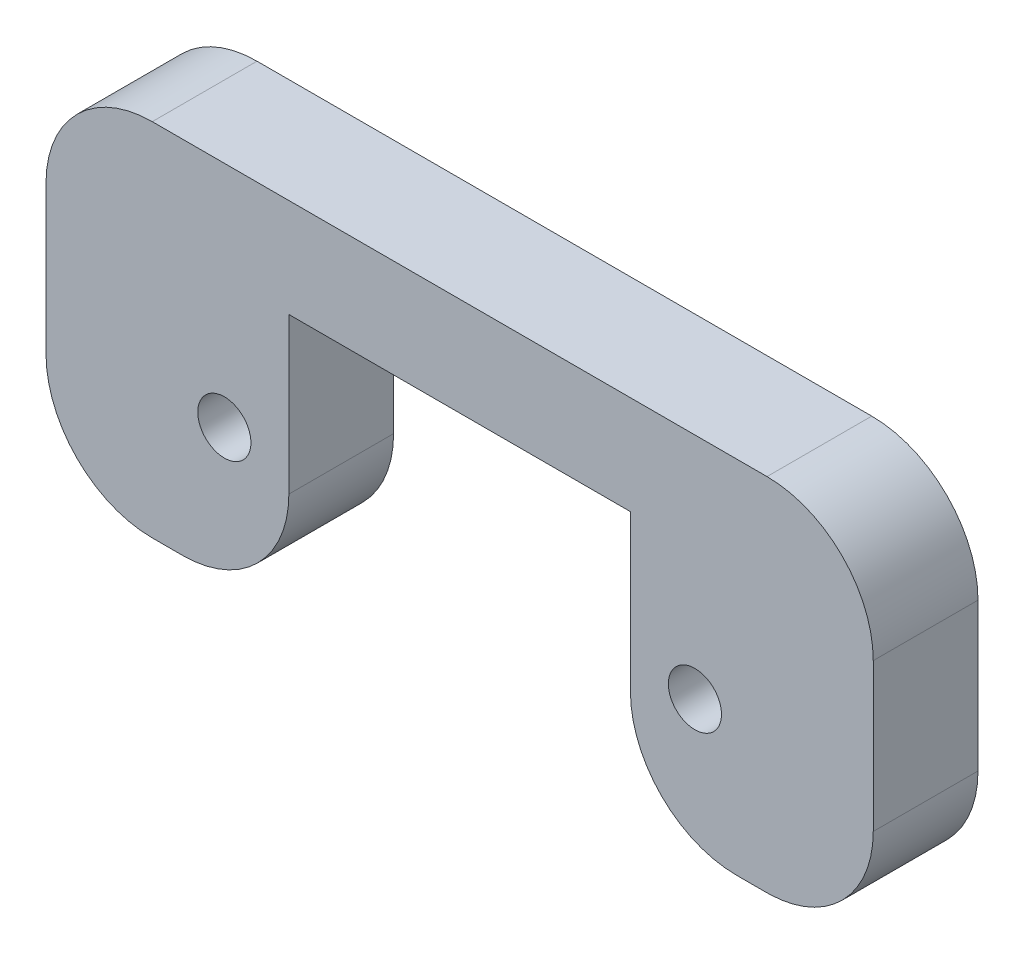
ISO-10303-21;
HEADER;
FILE_DESCRIPTION(('STEP AP214'),'2;1');
FILE_NAME('part.step','',(''),(''),'','','');
FILE_SCHEMA(('AUTOMOTIVE_DESIGN { 1 0 10303 214 1 1 1 1 }'));
ENDSEC;
DATA;
#1=APPLICATION_CONTEXT('core data for automotive mechanical design processes');
#2=APPLICATION_PROTOCOL_DEFINITION('international standard','automotive_design',2000,#1);
#3=PRODUCT_CONTEXT('',#1,'mechanical');
#4=PRODUCT('Part','Part','',(#3));
#5=PRODUCT_RELATED_PRODUCT_CATEGORY('part','',(#4));
#6=PRODUCT_DEFINITION_FORMATION('','',#4);
#7=PRODUCT_DEFINITION_CONTEXT('part definition',#1,'design');
#8=PRODUCT_DEFINITION('design','',#6,#7);
#9=PRODUCT_DEFINITION_SHAPE('','',#8);
#10=(LENGTH_UNIT() NAMED_UNIT(*) SI_UNIT(.MILLI.,.METRE.));
#11=(NAMED_UNIT(*) PLANE_ANGLE_UNIT() SI_UNIT($,.RADIAN.));
#12=(NAMED_UNIT(*) SI_UNIT($,.STERADIAN.) SOLID_ANGLE_UNIT());
#13=UNCERTAINTY_MEASURE_WITH_UNIT(LENGTH_MEASURE(1.E-05),#10,'distance_accuracy_value','');
#14=(GEOMETRIC_REPRESENTATION_CONTEXT(3) GLOBAL_UNCERTAINTY_ASSIGNED_CONTEXT((#13)) GLOBAL_UNIT_ASSIGNED_CONTEXT((#10,
#11,#12)) REPRESENTATION_CONTEXT('',''));
#15=CARTESIAN_POINT('',(0.,0.,0.));
#16=DIRECTION('',(0.,0.,1.));
#17=DIRECTION('',(1.,0.,0.));
#18=AXIS2_PLACEMENT_3D('',#15,#16,#17);
#19=CARTESIAN_POINT('',(0.,0.,6.9));
#20=DIRECTION('',(0.,0.,1.));
#21=DIRECTION('',(1.,0.,0.));
#22=AXIS2_PLACEMENT_3D('',#19,#20,#21);
#23=PLANE('',#22);
#24=DIRECTION('',(0.,1.,0.));
#25=VECTOR('',#24,1.);
#26=CARTESIAN_POINT('',(-27.25,0.,6.9));
#27=LINE('',#26,#25);
#28=CARTESIAN_POINT('',(-27.25,-73.,6.9));
#29=VERTEX_POINT('',#28);
#30=CARTESIAN_POINT('',(-27.25,-63.25,6.9));
#31=VERTEX_POINT('',#30);
#32=EDGE_CURVE('E167',#29,#31,#27,.T.);
#33=ORIENTED_EDGE('',*,*,#32,.F.);
#34=CARTESIAN_POINT('',(-20.25,-73.,6.9));
#35=DIRECTION('',(0.,0.,1.));
#36=DIRECTION('',(1.,0.,0.));
#37=AXIS2_PLACEMENT_3D('',#34,#35,#36);
#38=CIRCLE('',#37,7.);
#39=CARTESIAN_POINT('',(-20.25,-80.,6.9));
#40=VERTEX_POINT('',#39);
#41=EDGE_CURVE('E233',#29,#40,#38,.T.);
#42=ORIENTED_EDGE('',*,*,#41,.T.);
#43=DIRECTION('',(1.,0.,0.));
#44=VECTOR('',#43,1.);
#45=CARTESIAN_POINT('',(40.,-80.,6.9));
#46=LINE('',#45,#44);
#47=CARTESIAN_POINT('',(-18.25,-80.,6.9));
#48=VERTEX_POINT('',#47);
#49=EDGE_CURVE('E202',#40,#48,#46,.T.);
#50=ORIENTED_EDGE('',*,*,#49,.T.);
#51=CARTESIAN_POINT('',(-18.25,-73.,6.9));
#52=DIRECTION('',(0.,0.,1.));
#53=DIRECTION('',(1.,0.,0.));
#54=AXIS2_PLACEMENT_3D('',#51,#52,#53);
#55=CIRCLE('',#54,7.);
#56=CARTESIAN_POINT('',(-11.25,-73.,6.9));
#57=VERTEX_POINT('',#56);
#58=EDGE_CURVE('E227',#48,#57,#55,.T.);
#59=ORIENTED_EDGE('',*,*,#58,.T.);
#60=DIRECTION('',(0.,-1.,0.));
#61=VECTOR('',#60,1.);
#62=CARTESIAN_POINT('',(-11.25,0.,6.9));
#63=LINE('',#62,#61);
#64=CARTESIAN_POINT('',(-11.25,-62.75,6.9));
#65=VERTEX_POINT('',#64);
#66=EDGE_CURVE('E181',#65,#57,#63,.T.);
#67=ORIENTED_EDGE('',*,*,#66,.F.);
#68=DIRECTION('',(1.,0.,0.));
#69=VECTOR('',#68,1.);
#70=CARTESIAN_POINT('',(-21.25,-62.75,6.9));
#71=LINE('',#70,#69);
#72=CARTESIAN_POINT('',(11.2500000000001,-62.75,6.9));
#73=VERTEX_POINT('',#72);
#74=EDGE_CURVE('E163',#65,#73,#71,.T.);
#75=ORIENTED_EDGE('',*,*,#74,.T.);
#76=DIRECTION('',(0.,1.,0.));
#77=VECTOR('',#76,1.);
#78=CARTESIAN_POINT('',(11.25,0.,6.9));
#79=LINE('',#78,#77);
#80=CARTESIAN_POINT('',(11.2500000000001,-73.,6.9));
#81=VERTEX_POINT('',#80);
#82=EDGE_CURVE('E179',#81,#73,#79,.T.);
#83=ORIENTED_EDGE('',*,*,#82,.F.);
#84=CARTESIAN_POINT('',(18.2500000000001,-73.,6.9));
#85=DIRECTION('',(0.,0.,1.));
#86=DIRECTION('',(1.,0.,0.));
#87=AXIS2_PLACEMENT_3D('',#84,#85,#86);
#88=CIRCLE('',#87,7.);
#89=CARTESIAN_POINT('',(18.2500000000001,-80.,6.9));
#90=VERTEX_POINT('',#89);
#91=EDGE_CURVE('E225',#81,#90,#88,.T.);
#92=ORIENTED_EDGE('',*,*,#91,.T.);
#93=CARTESIAN_POINT('',(20.,-80.,6.9));
#94=VERTEX_POINT('',#93);
#95=EDGE_CURVE('E206',#90,#94,#46,.T.);
#96=ORIENTED_EDGE('',*,*,#95,.T.);
#97=CARTESIAN_POINT('',(20.,-60.,6.9));
#98=DIRECTION('',(0.,0.,1.));
#99=DIRECTION('',(1.,0.,0.));
#100=AXIS2_PLACEMENT_3D('',#97,#98,#99);
#101=CIRCLE('',#100,20.);
#102=CARTESIAN_POINT('',(20.3846153846155,-79.996301433163,6.9));
#103=VERTEX_POINT('',#102);
#104=EDGE_CURVE('E214',#94,#103,#101,.T.);
#105=ORIENTED_EDGE('',*,*,#104,.T.);
#106=CARTESIAN_POINT('',(20.25,-72.997595931556,6.9));
#107=DIRECTION('',(0.,0.,1.));
#108=DIRECTION('',(1.,0.,0.));
#109=AXIS2_PLACEMENT_3D('',#106,#107,#108);
#110=CIRCLE('',#109,7.);
#111=CARTESIAN_POINT('',(27.25,-72.997595931556,6.9));
#112=VERTEX_POINT('',#111);
#113=EDGE_CURVE('E223',#103,#112,#110,.T.);
#114=ORIENTED_EDGE('',*,*,#113,.T.);
#115=DIRECTION('',(0.,-1.,0.));
#116=VECTOR('',#115,1.);
#117=CARTESIAN_POINT('',(27.2500000000001,0.,6.9));
#118=LINE('',#117,#116);
#119=CARTESIAN_POINT('',(27.25,-63.25,6.9));
#120=VERTEX_POINT('',#119);
#121=EDGE_CURVE('E171',#120,#112,#118,.T.);
#122=ORIENTED_EDGE('',*,*,#121,.F.);
#123=CARTESIAN_POINT('',(20.2500000000001,-63.25,6.9));
#124=DIRECTION('',(0.,0.,1.));
#125=DIRECTION('',(1.,0.,0.));
#126=AXIS2_PLACEMENT_3D('',#123,#124,#125);
#127=CIRCLE('',#126,7.);
#128=CARTESIAN_POINT('',(20.2500000000001,-56.25,6.9));
#129=VERTEX_POINT('',#128);
#130=EDGE_CURVE('E229',#120,#129,#127,.T.);
#131=ORIENTED_EDGE('',*,*,#130,.T.);
#132=DIRECTION('',(1.,0.,0.));
#133=VECTOR('',#132,1.);
#134=CARTESIAN_POINT('',(-21.25,-56.25,6.9));
#135=LINE('',#134,#133);
#136=CARTESIAN_POINT('',(-20.25,-56.25,6.9));
#137=VERTEX_POINT('',#136);
#138=EDGE_CURVE('E196',#137,#129,#135,.T.);
#139=ORIENTED_EDGE('',*,*,#138,.F.);
#140=CARTESIAN_POINT('',(-20.25,-63.25,6.9));
#141=DIRECTION('',(0.,0.,1.));
#142=DIRECTION('',(1.,0.,0.));
#143=AXIS2_PLACEMENT_3D('',#140,#141,#142);
#144=CIRCLE('',#143,7.);
#145=EDGE_CURVE('E231',#137,#31,#144,.T.);
#146=ORIENTED_EDGE('',*,*,#145,.T.);
#147=EDGE_LOOP('',(#33,#42,#50,#59,#67,#75,#83,#92,#96,#105,#114,#122,#131,#139,#146));
#148=FACE_BOUND('',#147,.T.);
#149=CARTESIAN_POINT('',(-15.5,-71.32,6.9));
#150=DIRECTION('',(0.,0.,1.));
#151=DIRECTION('',(1.,0.,0.));
#152=AXIS2_PLACEMENT_3D('',#149,#150,#151);
#153=CIRCLE('',#152,1.75);
#154=CARTESIAN_POINT('',(-13.75,-71.32,6.9));
#155=VERTEX_POINT('',#154);
#156=EDGE_CURVE('E187',#155,#155,#153,.T.);
#157=ORIENTED_EDGE('',*,*,#156,.F.);
#158=EDGE_LOOP('',(#157));
#159=FACE_BOUND('',#158,.T.);
#160=CARTESIAN_POINT('',(15.5,-71.32,6.9));
#161=DIRECTION('',(0.,0.,1.));
#162=DIRECTION('',(1.,0.,0.));
#163=AXIS2_PLACEMENT_3D('',#160,#161,#162);
#164=CIRCLE('',#163,1.75);
#165=CARTESIAN_POINT('',(17.25,-71.32,6.9));
#166=VERTEX_POINT('',#165);
#167=EDGE_CURVE('E162',#166,#166,#164,.T.);
#168=ORIENTED_EDGE('',*,*,#167,.F.);
#169=EDGE_LOOP('',(#168));
#170=FACE_BOUND('',#169,.T.);
#171=ADVANCED_FACE('F35',(#148,#159,#170),#23,.T.);
#172=CARTESIAN_POINT('',(0.,0.,0.));
#173=DIRECTION('',(0.,0.,1.));
#174=DIRECTION('',(1.,0.,0.));
#175=AXIS2_PLACEMENT_3D('',#172,#173,#174);
#176=PLANE('',#175);
#177=DIRECTION('',(1.,0.,0.));
#178=VECTOR('',#177,1.);
#179=CARTESIAN_POINT('',(40.,-80.,0.));
#180=LINE('',#179,#178);
#181=CARTESIAN_POINT('',(-20.25,-80.,0.));
#182=VERTEX_POINT('',#181);
#183=CARTESIAN_POINT('',(-18.25,-80.,0.));
#184=VERTEX_POINT('',#183);
#185=EDGE_CURVE('E208',#182,#184,#180,.T.);
#186=ORIENTED_EDGE('',*,*,#185,.F.);
#187=CARTESIAN_POINT('',(-20.25,-73.,0.));
#188=DIRECTION('',(0.,0.,1.));
#189=DIRECTION('',(1.,0.,0.));
#190=AXIS2_PLACEMENT_3D('',#187,#188,#189);
#191=CIRCLE('',#190,7.);
#192=CARTESIAN_POINT('',(-27.25,-73.,0.));
#193=VERTEX_POINT('',#192);
#194=EDGE_CURVE('E248',#182,#193,#191,.F.);
#195=ORIENTED_EDGE('',*,*,#194,.T.);
#196=DIRECTION('',(0.,-1.,0.));
#197=VECTOR('',#196,1.);
#198=CARTESIAN_POINT('',(-27.25,-56.25,0.));
#199=LINE('',#198,#197);
#200=CARTESIAN_POINT('',(-27.25,-63.25,0.));
#201=VERTEX_POINT('',#200);
#202=EDGE_CURVE('E153',#201,#193,#199,.T.);
#203=ORIENTED_EDGE('',*,*,#202,.F.);
#204=CARTESIAN_POINT('',(-20.25,-63.25,0.));
#205=DIRECTION('',(0.,0.,1.));
#206=DIRECTION('',(1.,0.,0.));
#207=AXIS2_PLACEMENT_3D('',#204,#205,#206);
#208=CIRCLE('',#207,7.);
#209=CARTESIAN_POINT('',(-20.25,-56.25,0.));
#210=VERTEX_POINT('',#209);
#211=EDGE_CURVE('E246',#201,#210,#208,.F.);
#212=ORIENTED_EDGE('',*,*,#211,.T.);
#213=DIRECTION('',(1.,0.,0.));
#214=VECTOR('',#213,1.);
#215=CARTESIAN_POINT('',(-21.25,-56.25,0.));
#216=LINE('',#215,#214);
#217=CARTESIAN_POINT('',(20.2500000000001,-56.25,0.));
#218=VERTEX_POINT('',#217);
#219=EDGE_CURVE('E193',#210,#218,#216,.T.);
#220=ORIENTED_EDGE('',*,*,#219,.T.);
#221=CARTESIAN_POINT('',(20.2500000000001,-63.25,0.));
#222=DIRECTION('',(0.,0.,1.));
#223=DIRECTION('',(1.,0.,0.));
#224=AXIS2_PLACEMENT_3D('',#221,#222,#223);
#225=CIRCLE('',#224,7.);
#226=CARTESIAN_POINT('',(27.2500000000001,-63.25,0.));
#227=VERTEX_POINT('',#226);
#228=EDGE_CURVE('E244',#218,#227,#225,.F.);
#229=ORIENTED_EDGE('',*,*,#228,.T.);
#230=DIRECTION('',(0.,1.,0.));
#231=VECTOR('',#230,1.);
#232=CARTESIAN_POINT('',(27.2500000000001,-56.25,0.));
#233=LINE('',#232,#231);
#234=CARTESIAN_POINT('',(27.25,-72.997595931556,0.));
#235=VERTEX_POINT('',#234);
#236=EDGE_CURVE('E173',#235,#227,#233,.T.);
#237=ORIENTED_EDGE('',*,*,#236,.F.);
#238=CARTESIAN_POINT('',(20.25,-72.997595931556,0.));
#239=DIRECTION('',(0.,0.,1.));
#240=DIRECTION('',(1.,0.,0.));
#241=AXIS2_PLACEMENT_3D('',#238,#239,#240);
#242=CIRCLE('',#241,7.);
#243=CARTESIAN_POINT('',(20.3846153846155,-79.996301433163,0.));
#244=VERTEX_POINT('',#243);
#245=EDGE_CURVE('E239',#235,#244,#242,.F.);
#246=ORIENTED_EDGE('',*,*,#245,.T.);
#247=CARTESIAN_POINT('',(20.,-60.,0.));
#248=DIRECTION('',(0.,0.,1.));
#249=DIRECTION('',(1.,0.,0.));
#250=AXIS2_PLACEMENT_3D('',#247,#248,#249);
#251=CIRCLE('',#250,20.);
#252=CARTESIAN_POINT('',(20.,-80.,0.));
#253=VERTEX_POINT('',#252);
#254=EDGE_CURVE('E205',#244,#253,#251,.F.);
#255=ORIENTED_EDGE('',*,*,#254,.T.);
#256=CARTESIAN_POINT('',(18.2500000000001,-80.,0.));
#257=VERTEX_POINT('',#256);
#258=EDGE_CURVE('E199',#257,#253,#180,.T.);
#259=ORIENTED_EDGE('',*,*,#258,.F.);
#260=CARTESIAN_POINT('',(18.2500000000001,-73.,0.));
#261=DIRECTION('',(0.,0.,1.));
#262=DIRECTION('',(1.,0.,0.));
#263=AXIS2_PLACEMENT_3D('',#260,#261,#262);
#264=CIRCLE('',#263,7.);
#265=CARTESIAN_POINT('',(11.2500000000001,-73.,0.));
#266=VERTEX_POINT('',#265);
#267=EDGE_CURVE('E50',#257,#266,#264,.F.);
#268=ORIENTED_EDGE('',*,*,#267,.T.);
#269=DIRECTION('',(0.,-1.,0.));
#270=VECTOR('',#269,1.);
#271=CARTESIAN_POINT('',(11.2500000000001,-62.75,0.));
#272=LINE('',#271,#270);
#273=CARTESIAN_POINT('',(11.2500000000001,-62.75,0.));
#274=VERTEX_POINT('',#273);
#275=EDGE_CURVE('E152',#274,#266,#272,.T.);
#276=ORIENTED_EDGE('',*,*,#275,.F.);
#277=DIRECTION('',(-1.,0.,0.));
#278=VECTOR('',#277,1.);
#279=CARTESIAN_POINT('',(-21.25,-62.75,0.));
#280=LINE('',#279,#278);
#281=CARTESIAN_POINT('',(-11.25,-62.75,0.));
#282=VERTEX_POINT('',#281);
#283=EDGE_CURVE('E155',#274,#282,#280,.T.);
#284=ORIENTED_EDGE('',*,*,#283,.T.);
#285=DIRECTION('',(0.,1.,0.));
#286=VECTOR('',#285,1.);
#287=CARTESIAN_POINT('',(-11.25,-80.,0.));
#288=LINE('',#287,#286);
#289=CARTESIAN_POINT('',(-11.25,-73.,0.));
#290=VERTEX_POINT('',#289);
#291=EDGE_CURVE('E143',#290,#282,#288,.T.);
#292=ORIENTED_EDGE('',*,*,#291,.F.);
#293=CARTESIAN_POINT('',(-18.25,-73.,0.));
#294=DIRECTION('',(0.,0.,1.));
#295=DIRECTION('',(1.,0.,0.));
#296=AXIS2_PLACEMENT_3D('',#293,#294,#295);
#297=CIRCLE('',#296,7.);
#298=EDGE_CURVE('E242',#290,#184,#297,.F.);
#299=ORIENTED_EDGE('',*,*,#298,.T.);
#300=EDGE_LOOP('',(#186,#195,#203,#212,#220,#229,#237,#246,#255,#259,#268,#276,#284,#292,#299));
#301=FACE_BOUND('',#300,.T.);
#302=CARTESIAN_POINT('',(-15.5,-71.32,0.));
#303=DIRECTION('',(0.,0.,1.));
#304=DIRECTION('',(1.,0.,0.));
#305=AXIS2_PLACEMENT_3D('',#302,#303,#304);
#306=CIRCLE('',#305,1.75);
#307=CARTESIAN_POINT('',(-13.75,-71.32,0.));
#308=VERTEX_POINT('',#307);
#309=EDGE_CURVE('E190',#308,#308,#306,.T.);
#310=ORIENTED_EDGE('',*,*,#309,.T.);
#311=EDGE_LOOP('',(#310));
#312=FACE_BOUND('',#311,.T.);
#313=CARTESIAN_POINT('',(15.5,-71.32,0.));
#314=DIRECTION('',(0.,0.,1.));
#315=DIRECTION('',(1.,0.,0.));
#316=AXIS2_PLACEMENT_3D('',#313,#314,#315);
#317=CIRCLE('',#316,1.75);
#318=CARTESIAN_POINT('',(17.25,-71.32,0.));
#319=VERTEX_POINT('',#318);
#320=EDGE_CURVE('E184',#319,#319,#317,.T.);
#321=ORIENTED_EDGE('',*,*,#320,.T.);
#322=EDGE_LOOP('',(#321));
#323=FACE_BOUND('',#322,.T.);
#324=ADVANCED_FACE('F157',(#301,#312,#323),#176,.F.);
#325=CARTESIAN_POINT('',(40.,-80.,6.9));
#326=DIRECTION('',(0.,1.,0.));
#327=DIRECTION('',(-1.,0.,0.));
#328=AXIS2_PLACEMENT_3D('',#325,#326,#327);
#329=PLANE('',#328);
#330=ORIENTED_EDGE('',*,*,#49,.F.);
#331=DIRECTION('',(0.,0.,1.));
#332=VECTOR('',#331,1.);
#333=CARTESIAN_POINT('',(-20.25,-80.,6.9));
#334=LINE('',#333,#332);
#335=EDGE_CURVE('E237',#40,#182,#334,.F.);
#336=ORIENTED_EDGE('',*,*,#335,.T.);
#337=ORIENTED_EDGE('',*,*,#185,.T.);
#338=DIRECTION('',(0.,0.,-1.));
#339=VECTOR('',#338,1.);
#340=CARTESIAN_POINT('',(-18.25,-80.,6.9));
#341=LINE('',#340,#339);
#342=EDGE_CURVE('E235',#184,#48,#341,.F.);
#343=ORIENTED_EDGE('',*,*,#342,.T.);
#344=EDGE_LOOP('',(#330,#336,#337,#343));
#345=FACE_BOUND('',#344,.T.);
#346=ADVANCED_FACE('F303',(#345),#329,.F.);
#347=ORIENTED_EDGE('',*,*,#95,.F.);
#348=DIRECTION('',(0.,0.,-1.));
#349=VECTOR('',#348,1.);
#350=CARTESIAN_POINT('',(18.2500000000001,-80.,6.9));
#351=LINE('',#350,#349);
#352=EDGE_CURVE('E261',#90,#257,#351,.T.);
#353=ORIENTED_EDGE('',*,*,#352,.T.);
#354=ORIENTED_EDGE('',*,*,#258,.T.);
#355=DIRECTION('',(0.,0.,-1.));
#356=VECTOR('',#355,1.);
#357=CARTESIAN_POINT('',(20.,-80.,6.9));
#358=LINE('',#357,#356);
#359=EDGE_CURVE('E211',#253,#94,#358,.F.);
#360=ORIENTED_EDGE('',*,*,#359,.T.);
#361=EDGE_LOOP('',(#347,#353,#354,#360));
#362=FACE_BOUND('',#361,.T.);
#363=ADVANCED_FACE('F272',(#362),#329,.F.);
#364=CARTESIAN_POINT('',(-21.25,-56.25,6.9));
#365=DIRECTION('',(0.,1.,0.));
#366=DIRECTION('',(0.,0.,1.));
#367=AXIS2_PLACEMENT_3D('',#364,#365,#366);
#368=PLANE('',#367);
#369=ORIENTED_EDGE('',*,*,#219,.F.);
#370=DIRECTION('',(0.,0.,-1.));
#371=VECTOR('',#370,1.);
#372=CARTESIAN_POINT('',(-20.25,-56.25,6.9));
#373=LINE('',#372,#371);
#374=EDGE_CURVE('E253',#210,#137,#373,.F.);
#375=ORIENTED_EDGE('',*,*,#374,.T.);
#376=ORIENTED_EDGE('',*,*,#138,.T.);
#377=DIRECTION('',(0.,0.,-1.));
#378=VECTOR('',#377,1.);
#379=CARTESIAN_POINT('',(20.2500000000001,-56.25,0.));
#380=LINE('',#379,#378);
#381=EDGE_CURVE('E250',#129,#218,#380,.T.);
#382=ORIENTED_EDGE('',*,*,#381,.T.);
#383=EDGE_LOOP('',(#369,#375,#376,#382));
#384=FACE_BOUND('',#383,.T.);
#385=ADVANCED_FACE('F325',(#384),#368,.T.);
#386=CARTESIAN_POINT('',(-15.5,-71.32,0.));
#387=DIRECTION('',(0.,0.,1.));
#388=DIRECTION('',(1.,0.,0.));
#389=AXIS2_PLACEMENT_3D('',#386,#387,#388);
#390=CYLINDRICAL_SURFACE('',#389,1.75);
#391=CARTESIAN_POINT('',(-13.75,-71.32,0.));
#392=CARTESIAN_POINT('',(-13.75,-71.32,0.071875));
#393=CARTESIAN_POINT('',(-13.75,-71.32,0.14375));
#394=CARTESIAN_POINT('',(-13.75,-71.32,0.2875));
#395=CARTESIAN_POINT('',(-13.75,-71.32,0.359375));
#396=CARTESIAN_POINT('',(-13.75,-71.32,0.503125));
#397=CARTESIAN_POINT('',(-13.75,-71.32,0.575));
#398=CARTESIAN_POINT('',(-13.75,-71.32,0.71875));
#399=CARTESIAN_POINT('',(-13.75,-71.32,0.790625));
#400=CARTESIAN_POINT('',(-13.75,-71.32,0.934375));
#401=CARTESIAN_POINT('',(-13.75,-71.32,1.00625));
#402=CARTESIAN_POINT('',(-13.75,-71.32,1.15));
#403=CARTESIAN_POINT('',(-13.75,-71.32,1.221875));
#404=CARTESIAN_POINT('',(-13.75,-71.32,1.365625));
#405=CARTESIAN_POINT('',(-13.75,-71.32,1.4375));
#406=CARTESIAN_POINT('',(-13.75,-71.32,1.58125));
#407=CARTESIAN_POINT('',(-13.75,-71.32,1.653125));
#408=CARTESIAN_POINT('',(-13.75,-71.32,1.796875));
#409=CARTESIAN_POINT('',(-13.75,-71.32,1.86875));
#410=CARTESIAN_POINT('',(-13.75,-71.32,2.0125));
#411=CARTESIAN_POINT('',(-13.75,-71.32,2.084375));
#412=CARTESIAN_POINT('',(-13.75,-71.32,2.228125));
#413=CARTESIAN_POINT('',(-13.75,-71.32,2.3));
#414=CARTESIAN_POINT('',(-13.75,-71.32,2.44375));
#415=CARTESIAN_POINT('',(-13.75,-71.32,2.515625));
#416=CARTESIAN_POINT('',(-13.75,-71.32,2.659375));
#417=CARTESIAN_POINT('',(-13.75,-71.32,2.73125));
#418=CARTESIAN_POINT('',(-13.75,-71.32,2.875));
#419=CARTESIAN_POINT('',(-13.75,-71.32,2.946875));
#420=CARTESIAN_POINT('',(-13.75,-71.32,3.090625));
#421=CARTESIAN_POINT('',(-13.75,-71.32,3.1625));
#422=CARTESIAN_POINT('',(-13.75,-71.32,3.30625));
#423=CARTESIAN_POINT('',(-13.75,-71.32,3.378125));
#424=CARTESIAN_POINT('',(-13.75,-71.32,3.521875));
#425=CARTESIAN_POINT('',(-13.75,-71.32,3.59375));
#426=CARTESIAN_POINT('',(-13.75,-71.32,3.7375));
#427=CARTESIAN_POINT('',(-13.75,-71.32,3.809375));
#428=CARTESIAN_POINT('',(-13.75,-71.32,3.953125));
#429=CARTESIAN_POINT('',(-13.75,-71.32,4.025));
#430=CARTESIAN_POINT('',(-13.75,-71.32,4.16875));
#431=CARTESIAN_POINT('',(-13.75,-71.32,4.240625));
#432=CARTESIAN_POINT('',(-13.75,-71.32,4.384375));
#433=CARTESIAN_POINT('',(-13.75,-71.32,4.45625));
#434=CARTESIAN_POINT('',(-13.75,-71.32,4.6));
#435=CARTESIAN_POINT('',(-13.75,-71.32,4.671875));
#436=CARTESIAN_POINT('',(-13.75,-71.32,4.815625));
#437=CARTESIAN_POINT('',(-13.75,-71.32,4.8875));
#438=CARTESIAN_POINT('',(-13.75,-71.32,5.03125));
#439=CARTESIAN_POINT('',(-13.75,-71.32,5.103125));
#440=CARTESIAN_POINT('',(-13.75,-71.32,5.246875));
#441=CARTESIAN_POINT('',(-13.75,-71.32,5.31875));
#442=CARTESIAN_POINT('',(-13.75,-71.32,5.4625));
#443=CARTESIAN_POINT('',(-13.75,-71.32,5.534375));
#444=CARTESIAN_POINT('',(-13.75,-71.32,5.678125));
#445=CARTESIAN_POINT('',(-13.75,-71.32,5.75));
#446=CARTESIAN_POINT('',(-13.75,-71.32,5.89375));
#447=CARTESIAN_POINT('',(-13.75,-71.32,5.965625));
#448=CARTESIAN_POINT('',(-13.75,-71.32,6.109375));
#449=CARTESIAN_POINT('',(-13.75,-71.32,6.18125));
#450=CARTESIAN_POINT('',(-13.75,-71.32,6.325));
#451=CARTESIAN_POINT('',(-13.75,-71.32,6.396875));
#452=CARTESIAN_POINT('',(-13.75,-71.32,6.540625));
#453=CARTESIAN_POINT('',(-13.75,-71.32,6.6125));
#454=CARTESIAN_POINT('',(-13.75,-71.32,6.75625));
#455=CARTESIAN_POINT('',(-13.75,-71.32,6.828125));
#456=CARTESIAN_POINT('',(-13.75,-71.32,6.9));
#457=B_SPLINE_CURVE_WITH_KNOTS('',3,(#391,#392,#393,#394,#395,#396,#397,#398,#399,#400,#401,
#402,#403,#404,#405,#406,#407,#408,#409,#410,#411,#412,#413,#414,#415,#416,#417,#418,#419,#420,
#421,#422,#423,#424,#425,#426,#427,#428,#429,#430,#431,#432,#433,#434,#435,#436,#437,#438,#439,
#440,#441,#442,#443,#444,#445,#446,#447,#448,#449,#450,#451,#452,#453,#454,#455,#456),
.UNSPECIFIED.,.F.,.F.,(4,2,2,2,2,2,2,2,2,2,2,2,2,2,2,2,2,2,2,2,2,2,2,2,2,2,2,2,2,2,2,2,4),(0.,
0.215625,0.43125,0.646875,0.8625,1.078125,1.29375,1.509375,1.725,1.940625,2.15625,2.371875,
2.5875,2.803125,3.01875,3.234375,3.45,3.665625,3.88125,4.096875,4.3125,4.528125,4.74375,
4.959375,5.175,5.390625,5.60625,5.821875,6.0375,6.253125,6.46875,6.684375,6.9),.UNSPECIFIED.);
#458=EDGE_CURVE('BSEAM347',#308,#155,#457,.T.);
#459=ORIENTED_EDGE('',*,*,#309,.F.);
#460=ORIENTED_EDGE('',*,*,#156,.T.);
#461=ORIENTED_EDGE('',*,*,#458,.T.);
#462=ORIENTED_EDGE('',*,*,#458,.F.);
#463=EDGE_LOOP('',(#459,#461,#460,#462));
#464=FACE_BOUND('',#463,.T.);
#465=ADVANCED_FACE('F347',(#464),#390,.F.);
#466=CARTESIAN_POINT('',(15.5,-71.32,0.));
#467=DIRECTION('',(0.,0.,1.));
#468=DIRECTION('',(1.,0.,0.));
#469=AXIS2_PLACEMENT_3D('',#466,#467,#468);
#470=CYLINDRICAL_SURFACE('',#469,1.75);
#471=CARTESIAN_POINT('',(17.25,-71.32,0.));
#472=CARTESIAN_POINT('',(17.25,-71.32,0.071875));
#473=CARTESIAN_POINT('',(17.25,-71.32,0.14375));
#474=CARTESIAN_POINT('',(17.25,-71.32,0.2875));
#475=CARTESIAN_POINT('',(17.25,-71.32,0.359375));
#476=CARTESIAN_POINT('',(17.25,-71.32,0.503125));
#477=CARTESIAN_POINT('',(17.25,-71.32,0.575));
#478=CARTESIAN_POINT('',(17.25,-71.32,0.71875));
#479=CARTESIAN_POINT('',(17.25,-71.32,0.790625));
#480=CARTESIAN_POINT('',(17.25,-71.32,0.934375));
#481=CARTESIAN_POINT('',(17.25,-71.32,1.00625));
#482=CARTESIAN_POINT('',(17.25,-71.32,1.15));
#483=CARTESIAN_POINT('',(17.25,-71.32,1.221875));
#484=CARTESIAN_POINT('',(17.25,-71.32,1.365625));
#485=CARTESIAN_POINT('',(17.25,-71.32,1.4375));
#486=CARTESIAN_POINT('',(17.25,-71.32,1.58125));
#487=CARTESIAN_POINT('',(17.25,-71.32,1.653125));
#488=CARTESIAN_POINT('',(17.25,-71.32,1.796875));
#489=CARTESIAN_POINT('',(17.25,-71.32,1.86875));
#490=CARTESIAN_POINT('',(17.25,-71.32,2.0125));
#491=CARTESIAN_POINT('',(17.25,-71.32,2.084375));
#492=CARTESIAN_POINT('',(17.25,-71.32,2.228125));
#493=CARTESIAN_POINT('',(17.25,-71.32,2.3));
#494=CARTESIAN_POINT('',(17.25,-71.32,2.44375));
#495=CARTESIAN_POINT('',(17.25,-71.32,2.515625));
#496=CARTESIAN_POINT('',(17.25,-71.32,2.659375));
#497=CARTESIAN_POINT('',(17.25,-71.32,2.73125));
#498=CARTESIAN_POINT('',(17.25,-71.32,2.875));
#499=CARTESIAN_POINT('',(17.25,-71.32,2.946875));
#500=CARTESIAN_POINT('',(17.25,-71.32,3.090625));
#501=CARTESIAN_POINT('',(17.25,-71.32,3.1625));
#502=CARTESIAN_POINT('',(17.25,-71.32,3.30625));
#503=CARTESIAN_POINT('',(17.25,-71.32,3.378125));
#504=CARTESIAN_POINT('',(17.25,-71.32,3.521875));
#505=CARTESIAN_POINT('',(17.25,-71.32,3.59375));
#506=CARTESIAN_POINT('',(17.25,-71.32,3.7375));
#507=CARTESIAN_POINT('',(17.25,-71.32,3.809375));
#508=CARTESIAN_POINT('',(17.25,-71.32,3.953125));
#509=CARTESIAN_POINT('',(17.25,-71.32,4.025));
#510=CARTESIAN_POINT('',(17.25,-71.32,4.16875));
#511=CARTESIAN_POINT('',(17.25,-71.32,4.240625));
#512=CARTESIAN_POINT('',(17.25,-71.32,4.384375));
#513=CARTESIAN_POINT('',(17.25,-71.32,4.45625));
#514=CARTESIAN_POINT('',(17.25,-71.32,4.6));
#515=CARTESIAN_POINT('',(17.25,-71.32,4.671875));
#516=CARTESIAN_POINT('',(17.25,-71.32,4.815625));
#517=CARTESIAN_POINT('',(17.25,-71.32,4.8875));
#518=CARTESIAN_POINT('',(17.25,-71.32,5.03125));
#519=CARTESIAN_POINT('',(17.25,-71.32,5.103125));
#520=CARTESIAN_POINT('',(17.25,-71.32,5.246875));
#521=CARTESIAN_POINT('',(17.25,-71.32,5.31875));
#522=CARTESIAN_POINT('',(17.25,-71.32,5.4625));
#523=CARTESIAN_POINT('',(17.25,-71.32,5.534375));
#524=CARTESIAN_POINT('',(17.25,-71.32,5.678125));
#525=CARTESIAN_POINT('',(17.25,-71.32,5.75));
#526=CARTESIAN_POINT('',(17.25,-71.32,5.89375));
#527=CARTESIAN_POINT('',(17.25,-71.32,5.965625));
#528=CARTESIAN_POINT('',(17.25,-71.32,6.109375));
#529=CARTESIAN_POINT('',(17.25,-71.32,6.18125));
#530=CARTESIAN_POINT('',(17.25,-71.32,6.325));
#531=CARTESIAN_POINT('',(17.25,-71.32,6.396875));
#532=CARTESIAN_POINT('',(17.25,-71.32,6.540625));
#533=CARTESIAN_POINT('',(17.25,-71.32,6.6125));
#534=CARTESIAN_POINT('',(17.25,-71.32,6.75625));
#535=CARTESIAN_POINT('',(17.25,-71.32,6.828125));
#536=CARTESIAN_POINT('',(17.25,-71.32,6.9));
#537=B_SPLINE_CURVE_WITH_KNOTS('',3,(#471,#472,#473,#474,#475,#476,#477,#478,#479,#480,#481,
#482,#483,#484,#485,#486,#487,#488,#489,#490,#491,#492,#493,#494,#495,#496,#497,#498,#499,#500,
#501,#502,#503,#504,#505,#506,#507,#508,#509,#510,#511,#512,#513,#514,#515,#516,#517,#518,#519,
#520,#521,#522,#523,#524,#525,#526,#527,#528,#529,#530,#531,#532,#533,#534,#535,#536),
.UNSPECIFIED.,.F.,.F.,(4,2,2,2,2,2,2,2,2,2,2,2,2,2,2,2,2,2,2,2,2,2,2,2,2,2,2,2,2,2,2,2,4),(0.,
0.215625,0.43125,0.646875,0.8625,1.078125,1.29375,1.509375,1.725,1.940625,2.15625,2.371875,
2.5875,2.803125,3.01875,3.234375,3.45,3.665625,3.88125,4.096875,4.3125,4.528125,4.74375,
4.959375,5.175,5.390625,5.60625,5.821875,6.0375,6.253125,6.46875,6.684375,6.9),.UNSPECIFIED.);
#538=EDGE_CURVE('BSEAM332',#319,#166,#537,.T.);
#539=ORIENTED_EDGE('',*,*,#320,.F.);
#540=ORIENTED_EDGE('',*,*,#167,.T.);
#541=ORIENTED_EDGE('',*,*,#538,.T.);
#542=ORIENTED_EDGE('',*,*,#538,.F.);
#543=EDGE_LOOP('',(#539,#541,#540,#542));
#544=FACE_BOUND('',#543,.T.);
#545=ADVANCED_FACE('F332',(#544),#470,.F.);
#546=CARTESIAN_POINT('',(20.,-60.,6.9));
#547=DIRECTION('',(0.,0.,-1.));
#548=DIRECTION('',(-1.,0.,0.));
#549=AXIS2_PLACEMENT_3D('',#546,#547,#548);
#550=CYLINDRICAL_SURFACE('',#549,20.);
#551=ORIENTED_EDGE('',*,*,#254,.F.);
#552=DIRECTION('',(0.,0.,-1.));
#553=VECTOR('',#552,1.);
#554=CARTESIAN_POINT('',(20.3846153846155,-79.996301433163,6.9));
#555=LINE('',#554,#553);
#556=EDGE_CURVE('E11',#244,#103,#555,.F.);
#557=ORIENTED_EDGE('',*,*,#556,.T.);
#558=ORIENTED_EDGE('',*,*,#104,.F.);
#559=ORIENTED_EDGE('',*,*,#359,.F.);
#560=EDGE_LOOP('',(#551,#557,#558,#559));
#561=FACE_BOUND('',#560,.T.);
#562=ADVANCED_FACE('F279',(#561),#550,.T.);
#563=CARTESIAN_POINT('',(-21.25,-62.75,-42.9941856534114));
#564=DIRECTION('',(0.,-1.,0.));
#565=DIRECTION('',(0.,0.,-1.));
#566=AXIS2_PLACEMENT_3D('',#563,#564,#565);
#567=PLANE('',#566);
#568=ORIENTED_EDGE('',*,*,#283,.F.);
#569=DIRECTION('',(0.,0.,-1.));
#570=VECTOR('',#569,1.);
#571=CARTESIAN_POINT('',(11.2500000000001,-62.75,16.9));
#572=LINE('',#571,#570);
#573=EDGE_CURVE('E168',#73,#274,#572,.T.);
#574=ORIENTED_EDGE('',*,*,#573,.F.);
#575=ORIENTED_EDGE('',*,*,#74,.F.);
#576=DIRECTION('',(0.,0.,-1.));
#577=VECTOR('',#576,1.);
#578=CARTESIAN_POINT('',(-11.25,-62.75,16.9));
#579=LINE('',#578,#577);
#580=EDGE_CURVE('E148',#65,#282,#579,.T.);
#581=ORIENTED_EDGE('',*,*,#580,.T.);
#582=EDGE_LOOP('',(#568,#574,#575,#581));
#583=FACE_BOUND('',#582,.T.);
#584=ADVANCED_FACE('F165',(#583),#567,.T.);
#585=CARTESIAN_POINT('',(-27.25,-56.25,16.9));
#586=DIRECTION('',(1.,0.,0.));
#587=DIRECTION('',(0.,1.,0.));
#588=AXIS2_PLACEMENT_3D('',#585,#586,#587);
#589=PLANE('',#588);
#590=ORIENTED_EDGE('',*,*,#202,.T.);
#591=DIRECTION('',(0.,0.,1.));
#592=VECTOR('',#591,1.);
#593=CARTESIAN_POINT('',(-27.25,-73.,16.9));
#594=LINE('',#593,#592);
#595=EDGE_CURVE('E220',#193,#29,#594,.T.);
#596=ORIENTED_EDGE('',*,*,#595,.T.);
#597=ORIENTED_EDGE('',*,*,#32,.T.);
#598=DIRECTION('',(0.,0.,-1.));
#599=VECTOR('',#598,1.);
#600=CARTESIAN_POINT('',(-27.25,-63.25,0.));
#601=LINE('',#600,#599);
#602=EDGE_CURVE('E217',#31,#201,#601,.T.);
#603=ORIENTED_EDGE('',*,*,#602,.T.);
#604=EDGE_LOOP('',(#590,#596,#597,#603));
#605=FACE_BOUND('',#604,.T.);
#606=ADVANCED_FACE('F294',(#605),#589,.F.);
#607=CARTESIAN_POINT('',(27.2500000000001,-56.25,16.9));
#608=DIRECTION('',(-1.,0.,0.));
#609=DIRECTION('',(0.,-1.,0.));
#610=AXIS2_PLACEMENT_3D('',#607,#608,#609);
#611=PLANE('',#610);
#612=ORIENTED_EDGE('',*,*,#236,.T.);
#613=DIRECTION('',(0.,0.,-1.));
#614=VECTOR('',#613,1.);
#615=CARTESIAN_POINT('',(27.2500000000001,-63.25,6.9));
#616=LINE('',#615,#614);
#617=EDGE_CURVE('E258',#227,#120,#616,.F.);
#618=ORIENTED_EDGE('',*,*,#617,.T.);
#619=ORIENTED_EDGE('',*,*,#121,.T.);
#620=DIRECTION('',(0.,0.,1.));
#621=VECTOR('',#620,1.);
#622=CARTESIAN_POINT('',(27.25,-72.997595931556,0.));
#623=LINE('',#622,#621);
#624=EDGE_CURVE('E255',#112,#235,#623,.F.);
#625=ORIENTED_EDGE('',*,*,#624,.T.);
#626=EDGE_LOOP('',(#612,#618,#619,#625));
#627=FACE_BOUND('',#626,.T.);
#628=ADVANCED_FACE('F286',(#627),#611,.F.);
#629=CARTESIAN_POINT('',(-11.25,-80.,16.9));
#630=DIRECTION('',(-1.,0.,0.));
#631=DIRECTION('',(0.,0.,1.));
#632=AXIS2_PLACEMENT_3D('',#629,#630,#631);
#633=PLANE('',#632);
#634=ORIENTED_EDGE('',*,*,#66,.T.);
#635=DIRECTION('',(0.,0.,-1.));
#636=VECTOR('',#635,1.);
#637=CARTESIAN_POINT('',(-11.25,-73.,16.9));
#638=LINE('',#637,#636);
#639=EDGE_CURVE('E151',#57,#290,#638,.T.);
#640=ORIENTED_EDGE('',*,*,#639,.T.);
#641=ORIENTED_EDGE('',*,*,#291,.T.);
#642=ORIENTED_EDGE('',*,*,#580,.F.);
#643=EDGE_LOOP('',(#634,#640,#641,#642));
#644=FACE_BOUND('',#643,.T.);
#645=ADVANCED_FACE('F146',(#644),#633,.F.);
#646=CARTESIAN_POINT('',(11.2500000000001,-62.75,16.9));
#647=DIRECTION('',(1.,0.,0.));
#648=DIRECTION('',(0.,1.,0.));
#649=AXIS2_PLACEMENT_3D('',#646,#647,#648);
#650=PLANE('',#649);
#651=ORIENTED_EDGE('',*,*,#275,.T.);
#652=DIRECTION('',(0.,0.,-1.));
#653=VECTOR('',#652,1.);
#654=CARTESIAN_POINT('',(11.2500000000001,-73.,16.9));
#655=LINE('',#654,#653);
#656=EDGE_CURVE('E43',#266,#81,#655,.F.);
#657=ORIENTED_EDGE('',*,*,#656,.T.);
#658=ORIENTED_EDGE('',*,*,#82,.T.);
#659=ORIENTED_EDGE('',*,*,#573,.T.);
#660=EDGE_LOOP('',(#651,#657,#658,#659));
#661=FACE_BOUND('',#660,.T.);
#662=ADVANCED_FACE('F264',(#661),#650,.F.);
#663=CARTESIAN_POINT('',(-20.25,-73.,16.9));
#664=DIRECTION('',(0.,0.,1.));
#665=DIRECTION('',(1.,0.,0.));
#666=AXIS2_PLACEMENT_3D('',#663,#664,#665);
#667=CYLINDRICAL_SURFACE('',#666,7.);
#668=ORIENTED_EDGE('',*,*,#194,.F.);
#669=ORIENTED_EDGE('',*,*,#335,.F.);
#670=ORIENTED_EDGE('',*,*,#41,.F.);
#671=ORIENTED_EDGE('',*,*,#595,.F.);
#672=EDGE_LOOP('',(#668,#669,#670,#671));
#673=FACE_BOUND('',#672,.T.);
#674=ADVANCED_FACE('F298',(#673),#667,.T.);
#675=CARTESIAN_POINT('',(-20.25,-63.25,16.9));
#676=DIRECTION('',(0.,0.,1.));
#677=DIRECTION('',(1.,0.,0.));
#678=AXIS2_PLACEMENT_3D('',#675,#676,#677);
#679=CYLINDRICAL_SURFACE('',#678,7.);
#680=ORIENTED_EDGE('',*,*,#145,.F.);
#681=ORIENTED_EDGE('',*,*,#374,.F.);
#682=ORIENTED_EDGE('',*,*,#211,.F.);
#683=ORIENTED_EDGE('',*,*,#602,.F.);
#684=EDGE_LOOP('',(#680,#681,#682,#683));
#685=FACE_BOUND('',#684,.T.);
#686=ADVANCED_FACE('F315',(#685),#679,.T.);
#687=CARTESIAN_POINT('',(20.2500000000001,-63.25,6.9));
#688=DIRECTION('',(0.,0.,1.));
#689=DIRECTION('',(1.,0.,0.));
#690=AXIS2_PLACEMENT_3D('',#687,#688,#689);
#691=CYLINDRICAL_SURFACE('',#690,7.);
#692=ORIENTED_EDGE('',*,*,#130,.F.);
#693=ORIENTED_EDGE('',*,*,#617,.F.);
#694=ORIENTED_EDGE('',*,*,#228,.F.);
#695=ORIENTED_EDGE('',*,*,#381,.F.);
#696=EDGE_LOOP('',(#692,#693,#694,#695));
#697=FACE_BOUND('',#696,.T.);
#698=ADVANCED_FACE('F309',(#697),#691,.T.);
#699=CARTESIAN_POINT('',(-18.25,-73.,16.9));
#700=DIRECTION('',(0.,0.,-1.));
#701=DIRECTION('',(-1.,0.,0.));
#702=AXIS2_PLACEMENT_3D('',#699,#700,#701);
#703=CYLINDRICAL_SURFACE('',#702,7.);
#704=ORIENTED_EDGE('',*,*,#58,.F.);
#705=ORIENTED_EDGE('',*,*,#342,.F.);
#706=ORIENTED_EDGE('',*,*,#298,.F.);
#707=ORIENTED_EDGE('',*,*,#639,.F.);
#708=EDGE_LOOP('',(#704,#705,#706,#707));
#709=FACE_BOUND('',#708,.T.);
#710=ADVANCED_FACE('F307',(#709),#703,.T.);
#711=CARTESIAN_POINT('',(18.2500000000001,-73.,6.9));
#712=DIRECTION('',(0.,0.,-1.));
#713=DIRECTION('',(-1.,0.,0.));
#714=AXIS2_PLACEMENT_3D('',#711,#712,#713);
#715=CYLINDRICAL_SURFACE('',#714,7.);
#716=ORIENTED_EDGE('',*,*,#91,.F.);
#717=ORIENTED_EDGE('',*,*,#656,.F.);
#718=ORIENTED_EDGE('',*,*,#267,.F.);
#719=ORIENTED_EDGE('',*,*,#352,.F.);
#720=EDGE_LOOP('',(#716,#717,#718,#719));
#721=FACE_BOUND('',#720,.T.);
#722=ADVANCED_FACE('F270',(#721),#715,.T.);
#723=CARTESIAN_POINT('',(20.25,-72.997595931556,6.9));
#724=DIRECTION('',(0.,0.,-1.));
#725=DIRECTION('',(-1.,0.,0.));
#726=AXIS2_PLACEMENT_3D('',#723,#724,#725);
#727=CYLINDRICAL_SURFACE('',#726,7.);
#728=ORIENTED_EDGE('',*,*,#113,.F.);
#729=ORIENTED_EDGE('',*,*,#556,.F.);
#730=ORIENTED_EDGE('',*,*,#245,.F.);
#731=ORIENTED_EDGE('',*,*,#624,.F.);
#732=EDGE_LOOP('',(#728,#729,#730,#731));
#733=FACE_BOUND('',#732,.T.);
#734=ADVANCED_FACE('F37',(#733),#727,.T.);
#735=CLOSED_SHELL('',(#171,#324,#346,#363,#385,#465,#545,#562,#584,#606,#628,#645,#662,#674,
#686,#698,#710,#722,#734));
#736=MANIFOLD_SOLID_BREP('B2',#735);
#737=ADVANCED_BREP_SHAPE_REPRESENTATION('',(#18,#736),#14);
#738=SHAPE_DEFINITION_REPRESENTATION(#9,#737);
ENDSEC;
END-ISO-10303-21;
